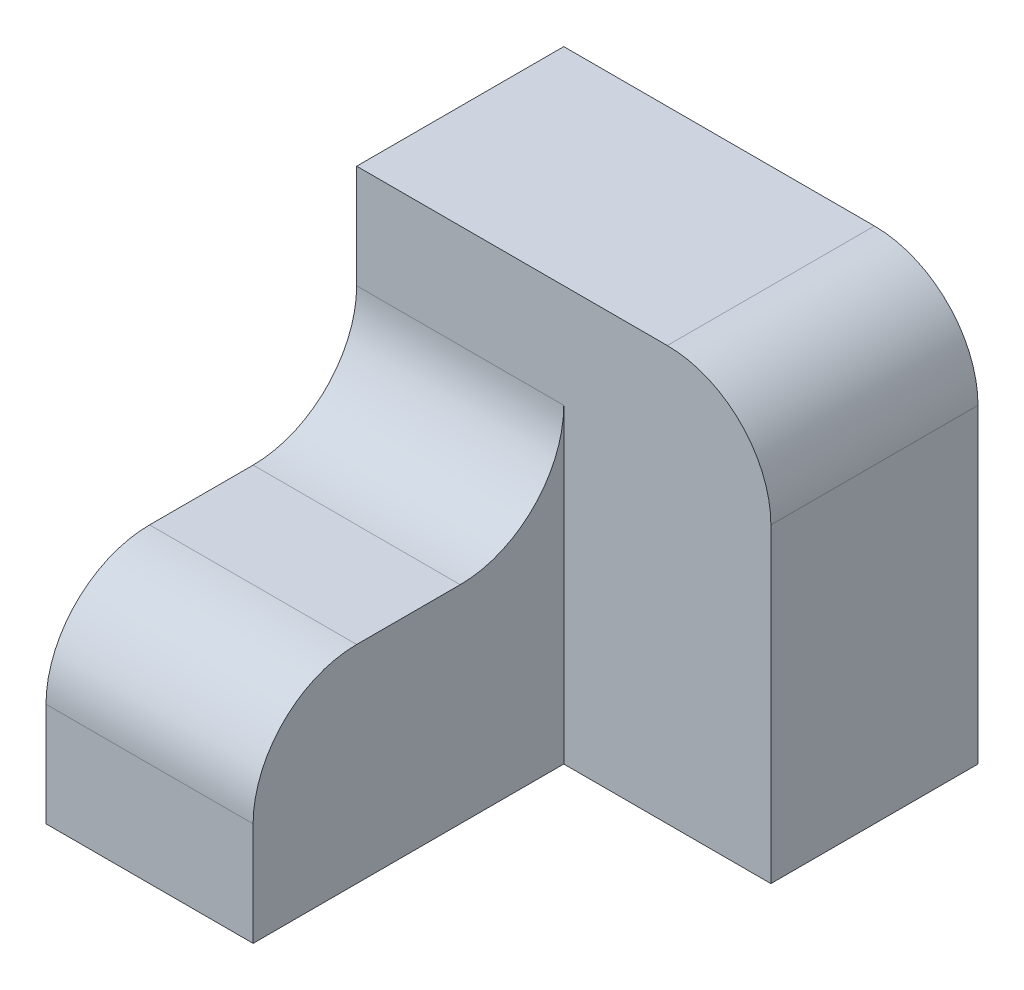
ISO-10303-21;
HEADER;
FILE_DESCRIPTION(('STEP AP214'),'2;1');
FILE_NAME('part.step','',(''),(''),'','','');
FILE_SCHEMA(('AUTOMOTIVE_DESIGN { 1 0 10303 214 1 1 1 1 }'));
ENDSEC;
DATA;
#1=APPLICATION_CONTEXT('core data for automotive mechanical design processes');
#2=APPLICATION_PROTOCOL_DEFINITION('international standard','automotive_design',2000,#1);
#3=PRODUCT_CONTEXT('',#1,'mechanical');
#4=PRODUCT('Part','Part','',(#3));
#5=PRODUCT_RELATED_PRODUCT_CATEGORY('part','',(#4));
#6=PRODUCT_DEFINITION_FORMATION('','',#4);
#7=PRODUCT_DEFINITION_CONTEXT('part definition',#1,'design');
#8=PRODUCT_DEFINITION('design','',#6,#7);
#9=PRODUCT_DEFINITION_SHAPE('','',#8);
#10=(LENGTH_UNIT() NAMED_UNIT(*) SI_UNIT(.MILLI.,.METRE.));
#11=(NAMED_UNIT(*) PLANE_ANGLE_UNIT() SI_UNIT($,.RADIAN.));
#12=(NAMED_UNIT(*) SI_UNIT($,.STERADIAN.) SOLID_ANGLE_UNIT());
#13=UNCERTAINTY_MEASURE_WITH_UNIT(LENGTH_MEASURE(1.E-05),#10,'distance_accuracy_value','');
#14=(GEOMETRIC_REPRESENTATION_CONTEXT(3) GLOBAL_UNCERTAINTY_ASSIGNED_CONTEXT((#13)) GLOBAL_UNIT_ASSIGNED_CONTEXT((#10,
#11,#12)) REPRESENTATION_CONTEXT('',''));
#15=CARTESIAN_POINT('',(0.,0.,0.));
#16=DIRECTION('',(0.,0.,1.));
#17=DIRECTION('',(1.,0.,0.));
#18=AXIS2_PLACEMENT_3D('',#15,#16,#17);
#19=CARTESIAN_POINT('',(20.,20.,0.));
#20=DIRECTION('',(-1.,0.,0.));
#21=DIRECTION('',(0.,0.,1.));
#22=AXIS2_PLACEMENT_3D('',#19,#20,#21);
#23=PLANE('',#22);
#24=DIRECTION('',(0.,0.,-1.));
#25=VECTOR('',#24,1.);
#26=CARTESIAN_POINT('',(20.,20.,0.));
#27=LINE('',#26,#25);
#28=CARTESIAN_POINT('',(20.,20.,-10.));
#29=VERTEX_POINT('',#28);
#30=CARTESIAN_POINT('',(20.,20.,-20.));
#31=VERTEX_POINT('',#30);
#32=EDGE_CURVE('E152',#29,#31,#27,.T.);
#33=ORIENTED_EDGE('',*,*,#32,.F.);
#34=CARTESIAN_POINT('',(20.,10.,-10.));
#35=DIRECTION('',(-1.,0.,0.));
#36=DIRECTION('',(0.,0.,1.));
#37=AXIS2_PLACEMENT_3D('',#34,#35,#36);
#38=CIRCLE('',#37,10.);
#39=CARTESIAN_POINT('',(20.,10.,0.));
#40=VERTEX_POINT('',#39);
#41=EDGE_CURVE('E58',#29,#40,#38,.F.);
#42=ORIENTED_EDGE('',*,*,#41,.T.);
#43=DIRECTION('',(0.,-1.,0.));
#44=VECTOR('',#43,1.);
#45=CARTESIAN_POINT('',(20.,20.,0.));
#46=LINE('',#45,#44);
#47=CARTESIAN_POINT('',(20.,0.,0.));
#48=VERTEX_POINT('',#47);
#49=EDGE_CURVE('E159',#40,#48,#46,.T.);
#50=ORIENTED_EDGE('',*,*,#49,.T.);
#51=DIRECTION('',(0.,0.,-1.));
#52=VECTOR('',#51,1.);
#53=CARTESIAN_POINT('',(20.,0.,0.));
#54=LINE('',#53,#52);
#55=CARTESIAN_POINT('',(20.,0.,-30.));
#56=VERTEX_POINT('',#55);
#57=EDGE_CURVE('E151',#48,#56,#54,.T.);
#58=ORIENTED_EDGE('',*,*,#57,.T.);
#59=DIRECTION('',(0.,-1.,0.));
#60=VECTOR('',#59,1.);
#61=CARTESIAN_POINT('',(20.,20.,-30.));
#62=LINE('',#61,#60);
#63=CARTESIAN_POINT('',(20.,30.,-30.));
#64=VERTEX_POINT('',#63);
#65=EDGE_CURVE('E168',#64,#56,#62,.T.);
#66=ORIENTED_EDGE('',*,*,#65,.F.);
#67=CARTESIAN_POINT('',(20.,30.,-20.));
#68=DIRECTION('',(-1.,0.,0.));
#69=DIRECTION('',(0.,0.,1.));
#70=AXIS2_PLACEMENT_3D('',#67,#68,#69);
#71=CIRCLE('',#70,10.);
#72=EDGE_CURVE('E11',#64,#31,#71,.T.);
#73=ORIENTED_EDGE('',*,*,#72,.T.);
#74=EDGE_LOOP('',(#33,#42,#50,#58,#66,#73));
#75=FACE_BOUND('',#74,.T.);
#76=ADVANCED_FACE('F35',(#75),#23,.F.);
#77=CARTESIAN_POINT('',(0.,20.,0.));
#78=DIRECTION('',(1.,0.,0.));
#79=DIRECTION('',(0.,0.,-1.));
#80=AXIS2_PLACEMENT_3D('',#77,#78,#79);
#81=PLANE('',#80);
#82=DIRECTION('',(0.,-1.,0.));
#83=VECTOR('',#82,1.);
#84=CARTESIAN_POINT('',(0.,20.,0.));
#85=LINE('',#84,#83);
#86=CARTESIAN_POINT('',(0.,10.,0.));
#87=VERTEX_POINT('',#86);
#88=CARTESIAN_POINT('',(0.,0.,0.));
#89=VERTEX_POINT('',#88);
#90=EDGE_CURVE('E166',#87,#89,#85,.T.);
#91=ORIENTED_EDGE('',*,*,#90,.F.);
#92=CARTESIAN_POINT('',(0.,10.,-10.));
#93=DIRECTION('',(1.,0.,0.));
#94=DIRECTION('',(0.,0.,-1.));
#95=AXIS2_PLACEMENT_3D('',#92,#93,#94);
#96=CIRCLE('',#95,10.);
#97=CARTESIAN_POINT('',(0.,20.,-10.));
#98=VERTEX_POINT('',#97);
#99=EDGE_CURVE('E189',#87,#98,#96,.F.);
#100=ORIENTED_EDGE('',*,*,#99,.T.);
#101=DIRECTION('',(0.,0.,1.));
#102=VECTOR('',#101,1.);
#103=CARTESIAN_POINT('',(0.,20.,0.));
#104=LINE('',#103,#102);
#105=CARTESIAN_POINT('',(0.,20.,-20.));
#106=VERTEX_POINT('',#105);
#107=EDGE_CURVE('E155',#106,#98,#104,.T.);
#108=ORIENTED_EDGE('',*,*,#107,.F.);
#109=CARTESIAN_POINT('',(0.,30.,-20.));
#110=DIRECTION('',(1.,0.,0.));
#111=DIRECTION('',(0.,0.,-1.));
#112=AXIS2_PLACEMENT_3D('',#109,#110,#111);
#113=CIRCLE('',#112,10.);
#114=CARTESIAN_POINT('',(0.,30.,-30.));
#115=VERTEX_POINT('',#114);
#116=EDGE_CURVE('E43',#106,#115,#113,.T.);
#117=ORIENTED_EDGE('',*,*,#116,.T.);
#118=DIRECTION('',(0.,-1.,0.));
#119=VECTOR('',#118,1.);
#120=CARTESIAN_POINT('',(0.,40.,-30.));
#121=LINE('',#120,#119);
#122=CARTESIAN_POINT('',(0.,40.,-30.));
#123=VERTEX_POINT('',#122);
#124=EDGE_CURVE('E133',#123,#115,#121,.T.);
#125=ORIENTED_EDGE('',*,*,#124,.F.);
#126=DIRECTION('',(0.,0.,1.));
#127=VECTOR('',#126,1.);
#128=CARTESIAN_POINT('',(0.,40.,0.));
#129=LINE('',#128,#127);
#130=CARTESIAN_POINT('',(0.,40.,-50.));
#131=VERTEX_POINT('',#130);
#132=EDGE_CURVE('E117',#131,#123,#129,.T.);
#133=ORIENTED_EDGE('',*,*,#132,.F.);
#134=DIRECTION('',(0.,-1.,0.));
#135=VECTOR('',#134,1.);
#136=CARTESIAN_POINT('',(0.,40.,-50.));
#137=LINE('',#136,#135);
#138=CARTESIAN_POINT('',(0.,0.,-50.));
#139=VERTEX_POINT('',#138);
#140=EDGE_CURVE('E126',#131,#139,#137,.T.);
#141=ORIENTED_EDGE('',*,*,#140,.T.);
#142=DIRECTION('',(0.,0.,1.));
#143=VECTOR('',#142,1.);
#144=CARTESIAN_POINT('',(0.,0.,0.));
#145=LINE('',#144,#143);
#146=EDGE_CURVE('E161',#139,#89,#145,.T.);
#147=ORIENTED_EDGE('',*,*,#146,.T.);
#148=EDGE_LOOP('',(#91,#100,#108,#117,#125,#133,#141,#147));
#149=FACE_BOUND('',#148,.T.);
#150=ADVANCED_FACE('F135',(#149),#81,.F.);
#151=CARTESIAN_POINT('',(0.,20.,0.));
#152=DIRECTION('',(0.,0.,-1.));
#153=DIRECTION('',(-1.,0.,0.));
#154=AXIS2_PLACEMENT_3D('',#151,#152,#153);
#155=PLANE('',#154);
#156=ORIENTED_EDGE('',*,*,#49,.F.);
#157=DIRECTION('',(1.,0.,0.));
#158=VECTOR('',#157,1.);
#159=CARTESIAN_POINT('',(0.,10.,0.));
#160=LINE('',#159,#158);
#161=EDGE_CURVE('E50',#40,#87,#160,.F.);
#162=ORIENTED_EDGE('',*,*,#161,.T.);
#163=ORIENTED_EDGE('',*,*,#90,.T.);
#164=DIRECTION('',(1.,0.,0.));
#165=VECTOR('',#164,1.);
#166=CARTESIAN_POINT('',(0.,0.,0.));
#167=LINE('',#166,#165);
#168=EDGE_CURVE('E156',#89,#48,#167,.T.);
#169=ORIENTED_EDGE('',*,*,#168,.T.);
#170=EDGE_LOOP('',(#156,#162,#163,#169));
#171=FACE_BOUND('',#170,.T.);
#172=ADVANCED_FACE('F205',(#171),#155,.F.);
#173=CARTESIAN_POINT('',(0.,20.,0.));
#174=DIRECTION('',(0.,1.,0.));
#175=DIRECTION('',(0.,0.,1.));
#176=AXIS2_PLACEMENT_3D('',#173,#174,#175);
#177=PLANE('',#176);
#178=ORIENTED_EDGE('',*,*,#107,.T.);
#179=DIRECTION('',(1.,0.,0.));
#180=VECTOR('',#179,1.);
#181=CARTESIAN_POINT('',(20.,20.,-10.));
#182=LINE('',#181,#180);
#183=EDGE_CURVE('E184',#98,#29,#182,.T.);
#184=ORIENTED_EDGE('',*,*,#183,.T.);
#185=ORIENTED_EDGE('',*,*,#32,.T.);
#186=DIRECTION('',(-1.,0.,0.));
#187=VECTOR('',#186,1.);
#188=CARTESIAN_POINT('',(0.,20.,-20.));
#189=LINE('',#188,#187);
#190=EDGE_CURVE('E181',#31,#106,#189,.T.);
#191=ORIENTED_EDGE('',*,*,#190,.T.);
#192=EDGE_LOOP('',(#178,#184,#185,#191));
#193=FACE_BOUND('',#192,.T.);
#194=ADVANCED_FACE('F199',(#193),#177,.T.);
#195=CARTESIAN_POINT('',(0.,0.,0.));
#196=DIRECTION('',(0.,1.,0.));
#197=DIRECTION('',(0.,0.,1.));
#198=AXIS2_PLACEMENT_3D('',#195,#196,#197);
#199=PLANE('',#198);
#200=ORIENTED_EDGE('',*,*,#57,.F.);
#201=ORIENTED_EDGE('',*,*,#168,.F.);
#202=ORIENTED_EDGE('',*,*,#146,.F.);
#203=DIRECTION('',(-1.,0.,0.));
#204=VECTOR('',#203,1.);
#205=CARTESIAN_POINT('',(0.,0.,-50.));
#206=LINE('',#205,#204);
#207=CARTESIAN_POINT('',(40.,0.,-50.));
#208=VERTEX_POINT('',#207);
#209=EDGE_CURVE('E129',#208,#139,#206,.T.);
#210=ORIENTED_EDGE('',*,*,#209,.F.);
#211=DIRECTION('',(0.,0.,-1.));
#212=VECTOR('',#211,1.);
#213=CARTESIAN_POINT('',(40.,0.,0.));
#214=LINE('',#213,#212);
#215=CARTESIAN_POINT('',(40.,0.,-30.));
#216=VERTEX_POINT('',#215);
#217=EDGE_CURVE('E144',#216,#208,#214,.T.);
#218=ORIENTED_EDGE('',*,*,#217,.F.);
#219=DIRECTION('',(-1.,0.,0.));
#220=VECTOR('',#219,1.);
#221=CARTESIAN_POINT('',(0.,0.,-30.));
#222=LINE('',#221,#220);
#223=EDGE_CURVE('E141',#216,#56,#222,.T.);
#224=ORIENTED_EDGE('',*,*,#223,.T.);
#225=EDGE_LOOP('',(#200,#201,#202,#210,#218,#224));
#226=FACE_BOUND('',#225,.T.);
#227=ADVANCED_FACE('F208',(#226),#199,.F.);
#228=CARTESIAN_POINT('',(0.,40.,-30.));
#229=DIRECTION('',(0.,0.,1.));
#230=DIRECTION('',(1.,0.,0.));
#231=AXIS2_PLACEMENT_3D('',#228,#229,#230);
#232=PLANE('',#231);
#233=DIRECTION('',(0.,-1.,0.));
#234=VECTOR('',#233,1.);
#235=CARTESIAN_POINT('',(40.,40.,-30.));
#236=LINE('',#235,#234);
#237=CARTESIAN_POINT('',(40.,30.,-30.));
#238=VERTEX_POINT('',#237);
#239=EDGE_CURVE('E149',#238,#216,#236,.T.);
#240=ORIENTED_EDGE('',*,*,#239,.F.);
#241=CARTESIAN_POINT('',(30.,30.,-30.));
#242=DIRECTION('',(0.,0.,1.));
#243=DIRECTION('',(1.,0.,0.));
#244=AXIS2_PLACEMENT_3D('',#241,#242,#243);
#245=CIRCLE('',#244,10.);
#246=CARTESIAN_POINT('',(30.,40.,-30.));
#247=VERTEX_POINT('',#246);
#248=EDGE_CURVE('E179',#238,#247,#245,.T.);
#249=ORIENTED_EDGE('',*,*,#248,.T.);
#250=DIRECTION('',(-1.,0.,0.));
#251=VECTOR('',#250,1.);
#252=CARTESIAN_POINT('',(0.,40.,-30.));
#253=LINE('',#252,#251);
#254=EDGE_CURVE('E122',#247,#123,#253,.T.);
#255=ORIENTED_EDGE('',*,*,#254,.T.);
#256=ORIENTED_EDGE('',*,*,#124,.T.);
#257=DIRECTION('',(-1.,0.,0.));
#258=VECTOR('',#257,1.);
#259=CARTESIAN_POINT('',(20.,30.,-30.));
#260=LINE('',#259,#258);
#261=EDGE_CURVE('E176',#115,#64,#260,.F.);
#262=ORIENTED_EDGE('',*,*,#261,.T.);
#263=ORIENTED_EDGE('',*,*,#65,.T.);
#264=ORIENTED_EDGE('',*,*,#223,.F.);
#265=EDGE_LOOP('',(#240,#249,#255,#256,#262,#263,#264));
#266=FACE_BOUND('',#265,.T.);
#267=ADVANCED_FACE('F196',(#266),#232,.T.);
#268=CARTESIAN_POINT('',(40.,40.,0.));
#269=DIRECTION('',(-1.,0.,0.));
#270=DIRECTION('',(0.,0.,1.));
#271=AXIS2_PLACEMENT_3D('',#268,#269,#270);
#272=PLANE('',#271);
#273=DIRECTION('',(0.,-1.,0.));
#274=VECTOR('',#273,1.);
#275=CARTESIAN_POINT('',(40.,40.,-50.));
#276=LINE('',#275,#274);
#277=CARTESIAN_POINT('',(40.,30.,-50.));
#278=VERTEX_POINT('',#277);
#279=EDGE_CURVE('E132',#278,#208,#276,.T.);
#280=ORIENTED_EDGE('',*,*,#279,.F.);
#281=DIRECTION('',(0.,0.,-1.));
#282=VECTOR('',#281,1.);
#283=CARTESIAN_POINT('',(40.,30.,-30.));
#284=LINE('',#283,#282);
#285=EDGE_CURVE('E174',#278,#238,#284,.F.);
#286=ORIENTED_EDGE('',*,*,#285,.T.);
#287=ORIENTED_EDGE('',*,*,#239,.T.);
#288=ORIENTED_EDGE('',*,*,#217,.T.);
#289=EDGE_LOOP('',(#280,#286,#287,#288));
#290=FACE_BOUND('',#289,.T.);
#291=ADVANCED_FACE('F217',(#290),#272,.F.);
#292=CARTESIAN_POINT('',(0.,40.,-50.));
#293=DIRECTION('',(0.,0.,1.));
#294=DIRECTION('',(1.,0.,0.));
#295=AXIS2_PLACEMENT_3D('',#292,#293,#294);
#296=PLANE('',#295);
#297=DIRECTION('',(-1.,0.,0.));
#298=VECTOR('',#297,1.);
#299=CARTESIAN_POINT('',(0.,40.,-50.));
#300=LINE('',#299,#298);
#301=CARTESIAN_POINT('',(30.,40.,-50.));
#302=VERTEX_POINT('',#301);
#303=EDGE_CURVE('E112',#302,#131,#300,.T.);
#304=ORIENTED_EDGE('',*,*,#303,.F.);
#305=CARTESIAN_POINT('',(30.,30.,-50.));
#306=DIRECTION('',(0.,0.,1.));
#307=DIRECTION('',(1.,0.,0.));
#308=AXIS2_PLACEMENT_3D('',#305,#306,#307);
#309=CIRCLE('',#308,10.);
#310=EDGE_CURVE('E172',#302,#278,#309,.F.);
#311=ORIENTED_EDGE('',*,*,#310,.T.);
#312=ORIENTED_EDGE('',*,*,#279,.T.);
#313=ORIENTED_EDGE('',*,*,#209,.T.);
#314=ORIENTED_EDGE('',*,*,#140,.F.);
#315=EDGE_LOOP('',(#304,#311,#312,#313,#314));
#316=FACE_BOUND('',#315,.T.);
#317=ADVANCED_FACE('F127',(#316),#296,.F.);
#318=CARTESIAN_POINT('',(0.,40.,0.));
#319=DIRECTION('',(0.,1.,0.));
#320=DIRECTION('',(0.,0.,1.));
#321=AXIS2_PLACEMENT_3D('',#318,#319,#320);
#322=PLANE('',#321);
#323=ORIENTED_EDGE('',*,*,#254,.F.);
#324=DIRECTION('',(0.,0.,-1.));
#325=VECTOR('',#324,1.);
#326=CARTESIAN_POINT('',(30.,40.,-50.));
#327=LINE('',#326,#325);
#328=EDGE_CURVE('E120',#247,#302,#327,.T.);
#329=ORIENTED_EDGE('',*,*,#328,.T.);
#330=ORIENTED_EDGE('',*,*,#303,.T.);
#331=ORIENTED_EDGE('',*,*,#132,.T.);
#332=EDGE_LOOP('',(#323,#329,#330,#331));
#333=FACE_BOUND('',#332,.T.);
#334=ADVANCED_FACE('F115',(#333),#322,.T.);
#335=CARTESIAN_POINT('',(30.,30.,0.));
#336=DIRECTION('',(0.,0.,1.));
#337=DIRECTION('',(1.,0.,0.));
#338=AXIS2_PLACEMENT_3D('',#335,#336,#337);
#339=CYLINDRICAL_SURFACE('',#338,10.);
#340=ORIENTED_EDGE('',*,*,#248,.F.);
#341=ORIENTED_EDGE('',*,*,#285,.F.);
#342=ORIENTED_EDGE('',*,*,#310,.F.);
#343=ORIENTED_EDGE('',*,*,#328,.F.);
#344=EDGE_LOOP('',(#340,#341,#342,#343));
#345=FACE_BOUND('',#344,.T.);
#346=ADVANCED_FACE('F215',(#345),#339,.T.);
#347=CARTESIAN_POINT('',(0.,10.,-10.));
#348=DIRECTION('',(-1.,0.,0.));
#349=DIRECTION('',(0.,0.,1.));
#350=AXIS2_PLACEMENT_3D('',#347,#348,#349);
#351=CYLINDRICAL_SURFACE('',#350,10.);
#352=ORIENTED_EDGE('',*,*,#99,.F.);
#353=ORIENTED_EDGE('',*,*,#161,.F.);
#354=ORIENTED_EDGE('',*,*,#41,.F.);
#355=ORIENTED_EDGE('',*,*,#183,.F.);
#356=EDGE_LOOP('',(#352,#353,#354,#355));
#357=FACE_BOUND('',#356,.T.);
#358=ADVANCED_FACE('F203',(#357),#351,.T.);
#359=CARTESIAN_POINT('',(0.,30.,-20.));
#360=DIRECTION('',(1.,0.,0.));
#361=DIRECTION('',(0.,0.,-1.));
#362=AXIS2_PLACEMENT_3D('',#359,#360,#361);
#363=CYLINDRICAL_SURFACE('',#362,10.);
#364=ORIENTED_EDGE('',*,*,#72,.F.);
#365=ORIENTED_EDGE('',*,*,#261,.F.);
#366=ORIENTED_EDGE('',*,*,#116,.F.);
#367=ORIENTED_EDGE('',*,*,#190,.F.);
#368=EDGE_LOOP('',(#364,#365,#366,#367));
#369=FACE_BOUND('',#368,.T.);
#370=ADVANCED_FACE('F37',(#369),#363,.F.);
#371=CLOSED_SHELL('',(#76,#150,#172,#194,#227,#267,#291,#317,#334,#346,#358,#370));
#372=MANIFOLD_SOLID_BREP('B2',#371);
#373=ADVANCED_BREP_SHAPE_REPRESENTATION('',(#18,#372),#14);
#374=SHAPE_DEFINITION_REPRESENTATION(#9,#373);
ENDSEC;
END-ISO-10303-21;
